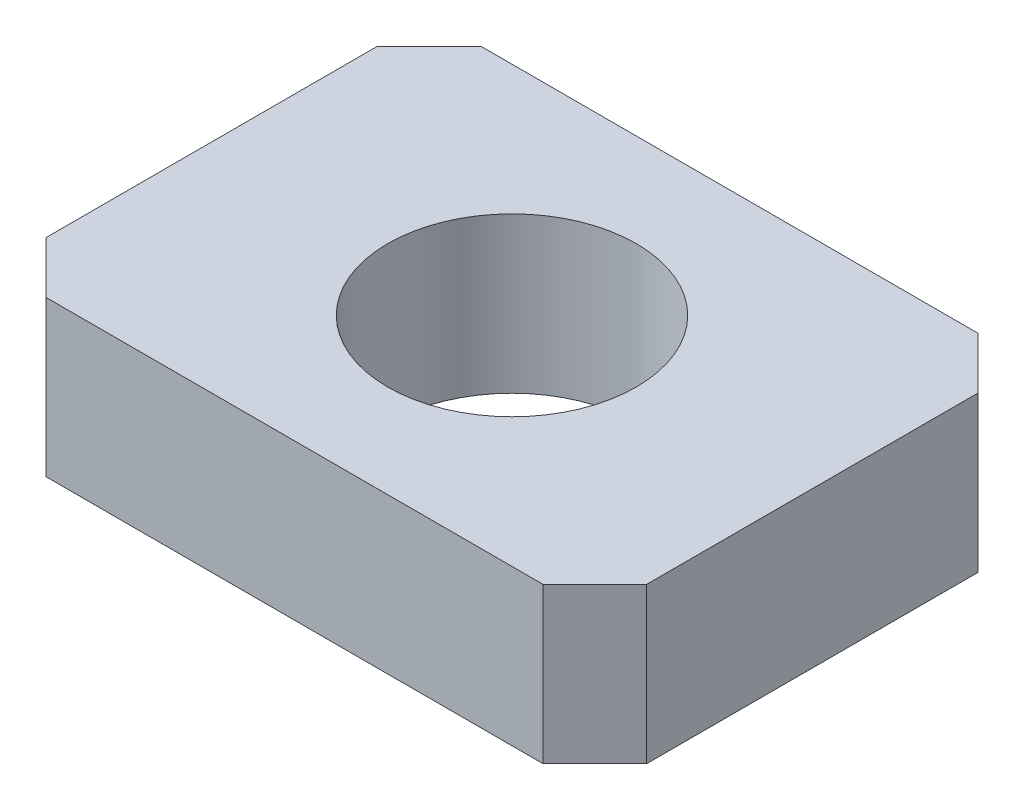
ISO-10303-21;
HEADER;
FILE_DESCRIPTION(('STEP AP214'),'2;1');
FILE_NAME('part.step','',(''),(''),'','','');
FILE_SCHEMA(('AUTOMOTIVE_DESIGN { 1 0 10303 214 1 1 1 1 }'));
ENDSEC;
DATA;
#1=APPLICATION_CONTEXT('core data for automotive mechanical design processes');
#2=APPLICATION_PROTOCOL_DEFINITION('international standard','automotive_design',2000,#1);
#3=PRODUCT_CONTEXT('',#1,'mechanical');
#4=PRODUCT('Part','Part','',(#3));
#5=PRODUCT_RELATED_PRODUCT_CATEGORY('part','',(#4));
#6=PRODUCT_DEFINITION_FORMATION('','',#4);
#7=PRODUCT_DEFINITION_CONTEXT('part definition',#1,'design');
#8=PRODUCT_DEFINITION('design','',#6,#7);
#9=PRODUCT_DEFINITION_SHAPE('','',#8);
#10=(LENGTH_UNIT() NAMED_UNIT(*) SI_UNIT(.MILLI.,.METRE.));
#11=(NAMED_UNIT(*) PLANE_ANGLE_UNIT() SI_UNIT($,.RADIAN.));
#12=(NAMED_UNIT(*) SI_UNIT($,.STERADIAN.) SOLID_ANGLE_UNIT());
#13=UNCERTAINTY_MEASURE_WITH_UNIT(LENGTH_MEASURE(1.E-05),#10,'distance_accuracy_value','');
#14=(GEOMETRIC_REPRESENTATION_CONTEXT(3) GLOBAL_UNCERTAINTY_ASSIGNED_CONTEXT((#13)) GLOBAL_UNIT_ASSIGNED_CONTEXT((#10,
#11,#12)) REPRESENTATION_CONTEXT('',''));
#15=CARTESIAN_POINT('',(0.,0.,0.));
#16=DIRECTION('',(0.,0.,1.));
#17=DIRECTION('',(1.,0.,0.));
#18=AXIS2_PLACEMENT_3D('',#15,#16,#17);
#19=CARTESIAN_POINT('',(0.,1.5,0.));
#20=DIRECTION('',(0.,-1.,0.));
#21=DIRECTION('',(0.,0.,-1.));
#22=AXIS2_PLACEMENT_3D('',#19,#20,#21);
#23=PLANE('',#22);
#24=DIRECTION('',(0.,0.,-1.));
#25=VECTOR('',#24,1.);
#26=CARTESIAN_POINT('',(2.9,1.5,2.1));
#27=LINE('',#26,#25);
#28=CARTESIAN_POINT('',(2.9,1.5,1.6));
#29=VERTEX_POINT('',#28);
#30=CARTESIAN_POINT('',(2.9,1.5,-1.6));
#31=VERTEX_POINT('',#30);
#32=EDGE_CURVE('E145',#29,#31,#27,.T.);
#33=ORIENTED_EDGE('',*,*,#32,.T.);
#34=DIRECTION('',(0.707106781186546,0.,0.707106781186549));
#35=VECTOR('',#34,1.);
#36=CARTESIAN_POINT('',(2.4,1.5,-2.1));
#37=LINE('',#36,#35);
#38=CARTESIAN_POINT('',(2.4,1.5,-2.1));
#39=VERTEX_POINT('',#38);
#40=EDGE_CURVE('E163',#31,#39,#37,.F.);
#41=ORIENTED_EDGE('',*,*,#40,.T.);
#42=DIRECTION('',(-1.,0.,0.));
#43=VECTOR('',#42,1.);
#44=CARTESIAN_POINT('',(-2.9,1.5,-2.1));
#45=LINE('',#44,#43);
#46=CARTESIAN_POINT('',(-2.4,1.5,-2.1));
#47=VERTEX_POINT('',#46);
#48=EDGE_CURVE('E127',#39,#47,#45,.T.);
#49=ORIENTED_EDGE('',*,*,#48,.T.);
#50=DIRECTION('',(0.707106781186549,0.,-0.707106781186546));
#51=VECTOR('',#50,1.);
#52=CARTESIAN_POINT('',(-2.9,1.5,-1.6));
#53=LINE('',#52,#51);
#54=CARTESIAN_POINT('',(-2.9,1.5,-1.6));
#55=VERTEX_POINT('',#54);
#56=EDGE_CURVE('E155',#47,#55,#53,.F.);
#57=ORIENTED_EDGE('',*,*,#56,.T.);
#58=DIRECTION('',(0.,0.,1.));
#59=VECTOR('',#58,1.);
#60=CARTESIAN_POINT('',(-2.9,1.5,-2.1));
#61=LINE('',#60,#59);
#62=CARTESIAN_POINT('',(-2.9,1.5,1.6));
#63=VERTEX_POINT('',#62);
#64=EDGE_CURVE('E175',#55,#63,#61,.T.);
#65=ORIENTED_EDGE('',*,*,#64,.T.);
#66=DIRECTION('',(-0.707106781186546,0.,-0.707106781186549));
#67=VECTOR('',#66,1.);
#68=CARTESIAN_POINT('',(-2.4,1.5,2.1));
#69=LINE('',#68,#67);
#70=CARTESIAN_POINT('',(-2.4,1.5,2.1));
#71=VERTEX_POINT('',#70);
#72=EDGE_CURVE('E63',#63,#71,#69,.F.);
#73=ORIENTED_EDGE('',*,*,#72,.T.);
#74=DIRECTION('',(1.,0.,0.));
#75=VECTOR('',#74,1.);
#76=CARTESIAN_POINT('',(-2.9,1.5,2.1));
#77=LINE('',#76,#75);
#78=CARTESIAN_POINT('',(2.4,1.5,2.1));
#79=VERTEX_POINT('',#78);
#80=EDGE_CURVE('E146',#71,#79,#77,.T.);
#81=ORIENTED_EDGE('',*,*,#80,.T.);
#82=DIRECTION('',(-0.707106781186549,0.,0.707106781186546));
#83=VECTOR('',#82,1.);
#84=CARTESIAN_POINT('',(2.9,1.5,1.6));
#85=LINE('',#84,#83);
#86=EDGE_CURVE('E160',#79,#29,#85,.F.);
#87=ORIENTED_EDGE('',*,*,#86,.T.);
#88=EDGE_LOOP('',(#33,#41,#49,#57,#65,#73,#81,#87));
#89=FACE_BOUND('',#88,.T.);
#90=CARTESIAN_POINT('',(0.,1.5,0.));
#91=DIRECTION('',(0.,1.,0.));
#92=DIRECTION('',(0.,0.,1.));
#93=AXIS2_PLACEMENT_3D('',#90,#91,#92);
#94=CIRCLE('',#93,1.2);
#95=CARTESIAN_POINT('',(0.,1.5,1.2));
#96=VERTEX_POINT('',#95);
#97=EDGE_CURVE('E140',#96,#96,#94,.T.);
#98=ORIENTED_EDGE('',*,*,#97,.F.);
#99=EDGE_LOOP('',(#98));
#100=FACE_BOUND('',#99,.T.);
#101=ADVANCED_FACE('F40',(#89,#100),#23,.F.);
#102=CARTESIAN_POINT('',(0.,0.,0.));
#103=DIRECTION('',(0.,-1.,0.));
#104=DIRECTION('',(0.,0.,-1.));
#105=AXIS2_PLACEMENT_3D('',#102,#103,#104);
#106=PLANE('',#105);
#107=DIRECTION('',(-1.,0.,0.));
#108=VECTOR('',#107,1.);
#109=CARTESIAN_POINT('',(-2.9,0.,-2.1));
#110=LINE('',#109,#108);
#111=CARTESIAN_POINT('',(2.4,0.,-2.1));
#112=VERTEX_POINT('',#111);
#113=CARTESIAN_POINT('',(-2.4,0.,-2.1));
#114=VERTEX_POINT('',#113);
#115=EDGE_CURVE('E124',#112,#114,#110,.T.);
#116=ORIENTED_EDGE('',*,*,#115,.F.);
#117=DIRECTION('',(-0.707106781186546,0.,-0.707106781186549));
#118=VECTOR('',#117,1.);
#119=CARTESIAN_POINT('',(2.25000000000001,0.,-2.25));
#120=LINE('',#119,#118);
#121=CARTESIAN_POINT('',(2.9,0.,-1.6));
#122=VERTEX_POINT('',#121);
#123=EDGE_CURVE('E107',#112,#122,#120,.F.);
#124=ORIENTED_EDGE('',*,*,#123,.T.);
#125=DIRECTION('',(0.,0.,-1.));
#126=VECTOR('',#125,1.);
#127=CARTESIAN_POINT('',(2.9,0.,2.1));
#128=LINE('',#127,#126);
#129=CARTESIAN_POINT('',(2.9,0.,1.6));
#130=VERTEX_POINT('',#129);
#131=EDGE_CURVE('E135',#130,#122,#128,.T.);
#132=ORIENTED_EDGE('',*,*,#131,.F.);
#133=DIRECTION('',(0.707106781186549,0.,-0.707106781186546));
#134=VECTOR('',#133,1.);
#135=CARTESIAN_POINT('',(2.24999999999999,0.,2.25));
#136=LINE('',#135,#134);
#137=CARTESIAN_POINT('',(2.4,0.,2.1));
#138=VERTEX_POINT('',#137);
#139=EDGE_CURVE('E118',#130,#138,#136,.F.);
#140=ORIENTED_EDGE('',*,*,#139,.T.);
#141=DIRECTION('',(1.,0.,0.));
#142=VECTOR('',#141,1.);
#143=CARTESIAN_POINT('',(-2.9,0.,2.1));
#144=LINE('',#143,#142);
#145=CARTESIAN_POINT('',(-2.4,0.,2.1));
#146=VERTEX_POINT('',#145);
#147=EDGE_CURVE('E138',#146,#138,#144,.T.);
#148=ORIENTED_EDGE('',*,*,#147,.F.);
#149=DIRECTION('',(0.707106781186546,0.,0.707106781186549));
#150=VECTOR('',#149,1.);
#151=CARTESIAN_POINT('',(-2.25,0.,2.25));
#152=LINE('',#151,#150);
#153=CARTESIAN_POINT('',(-2.9,0.,1.6));
#154=VERTEX_POINT('',#153);
#155=EDGE_CURVE('E149',#146,#154,#152,.F.);
#156=ORIENTED_EDGE('',*,*,#155,.T.);
#157=DIRECTION('',(0.,0.,1.));
#158=VECTOR('',#157,1.);
#159=CARTESIAN_POINT('',(-2.9,0.,-2.1));
#160=LINE('',#159,#158);
#161=CARTESIAN_POINT('',(-2.9,0.,-1.6));
#162=VERTEX_POINT('',#161);
#163=EDGE_CURVE('E134',#162,#154,#160,.T.);
#164=ORIENTED_EDGE('',*,*,#163,.F.);
#165=DIRECTION('',(-0.707106781186549,0.,0.707106781186546));
#166=VECTOR('',#165,1.);
#167=CARTESIAN_POINT('',(-2.24999999999999,0.,-2.25));
#168=LINE('',#167,#166);
#169=EDGE_CURVE('E128',#162,#114,#168,.F.);
#170=ORIENTED_EDGE('',*,*,#169,.T.);
#171=EDGE_LOOP('',(#116,#124,#132,#140,#148,#156,#164,#170));
#172=FACE_BOUND('',#171,.T.);
#173=CARTESIAN_POINT('',(0.,0.,0.));
#174=DIRECTION('',(0.,1.,0.));
#175=DIRECTION('',(0.,0.,1.));
#176=AXIS2_PLACEMENT_3D('',#173,#174,#175);
#177=CIRCLE('',#176,1.2);
#178=CARTESIAN_POINT('',(0.,0.,1.2));
#179=VERTEX_POINT('',#178);
#180=EDGE_CURVE('E200',#179,#179,#177,.T.);
#181=ORIENTED_EDGE('',*,*,#180,.T.);
#182=EDGE_LOOP('',(#181));
#183=FACE_BOUND('',#182,.T.);
#184=ADVANCED_FACE('F131',(#172,#183),#106,.T.);
#185=CARTESIAN_POINT('',(2.9,1.5,2.1));
#186=DIRECTION('',(-1.,0.,0.));
#187=DIRECTION('',(0.,0.,1.));
#188=AXIS2_PLACEMENT_3D('',#185,#186,#187);
#189=PLANE('',#188);
#190=ORIENTED_EDGE('',*,*,#131,.T.);
#191=DIRECTION('',(0.,1.,0.));
#192=VECTOR('',#191,1.);
#193=CARTESIAN_POINT('',(2.9,1.5,-1.6));
#194=LINE('',#193,#192);
#195=EDGE_CURVE('E112',#122,#31,#194,.T.);
#196=ORIENTED_EDGE('',*,*,#195,.T.);
#197=ORIENTED_EDGE('',*,*,#32,.F.);
#198=DIRECTION('',(0.,-1.,0.));
#199=VECTOR('',#198,1.);
#200=CARTESIAN_POINT('',(2.9,1.5,1.6));
#201=LINE('',#200,#199);
#202=EDGE_CURVE('E117',#29,#130,#201,.T.);
#203=ORIENTED_EDGE('',*,*,#202,.T.);
#204=EDGE_LOOP('',(#190,#196,#197,#203));
#205=FACE_BOUND('',#204,.T.);
#206=ADVANCED_FACE('F215',(#205),#189,.F.);
#207=CARTESIAN_POINT('',(-2.9,1.5,-2.1));
#208=DIRECTION('',(0.,0.,1.));
#209=DIRECTION('',(1.,0.,0.));
#210=AXIS2_PLACEMENT_3D('',#207,#208,#209);
#211=PLANE('',#210);
#212=ORIENTED_EDGE('',*,*,#48,.F.);
#213=DIRECTION('',(0.,-1.,0.));
#214=VECTOR('',#213,1.);
#215=CARTESIAN_POINT('',(2.4,1.5,-2.1));
#216=LINE('',#215,#214);
#217=EDGE_CURVE('E111',#39,#112,#216,.T.);
#218=ORIENTED_EDGE('',*,*,#217,.T.);
#219=ORIENTED_EDGE('',*,*,#115,.T.);
#220=DIRECTION('',(0.,1.,0.));
#221=VECTOR('',#220,1.);
#222=CARTESIAN_POINT('',(-2.4,1.5,-2.1));
#223=LINE('',#222,#221);
#224=EDGE_CURVE('E129',#114,#47,#223,.T.);
#225=ORIENTED_EDGE('',*,*,#224,.T.);
#226=EDGE_LOOP('',(#212,#218,#219,#225));
#227=FACE_BOUND('',#226,.T.);
#228=ADVANCED_FACE('F123',(#227),#211,.F.);
#229=CARTESIAN_POINT('',(-2.9,1.5,-2.1));
#230=DIRECTION('',(1.,0.,0.));
#231=DIRECTION('',(0.,0.,-1.));
#232=AXIS2_PLACEMENT_3D('',#229,#230,#231);
#233=PLANE('',#232);
#234=ORIENTED_EDGE('',*,*,#163,.T.);
#235=DIRECTION('',(0.,1.,0.));
#236=VECTOR('',#235,1.);
#237=CARTESIAN_POINT('',(-2.9,1.5,1.6));
#238=LINE('',#237,#236);
#239=EDGE_CURVE('E12',#154,#63,#238,.T.);
#240=ORIENTED_EDGE('',*,*,#239,.T.);
#241=ORIENTED_EDGE('',*,*,#64,.F.);
#242=DIRECTION('',(0.,-1.,0.));
#243=VECTOR('',#242,1.);
#244=CARTESIAN_POINT('',(-2.9,1.5,-1.6));
#245=LINE('',#244,#243);
#246=EDGE_CURVE('E49',#55,#162,#245,.T.);
#247=ORIENTED_EDGE('',*,*,#246,.T.);
#248=EDGE_LOOP('',(#234,#240,#241,#247));
#249=FACE_BOUND('',#248,.T.);
#250=ADVANCED_FACE('F173',(#249),#233,.F.);
#251=CARTESIAN_POINT('',(-2.9,1.5,2.1));
#252=DIRECTION('',(0.,0.,-1.));
#253=DIRECTION('',(-1.,0.,0.));
#254=AXIS2_PLACEMENT_3D('',#251,#252,#253);
#255=PLANE('',#254);
#256=ORIENTED_EDGE('',*,*,#147,.T.);
#257=DIRECTION('',(0.,1.,0.));
#258=VECTOR('',#257,1.);
#259=CARTESIAN_POINT('',(2.4,1.5,2.1));
#260=LINE('',#259,#258);
#261=EDGE_CURVE('E56',#138,#79,#260,.T.);
#262=ORIENTED_EDGE('',*,*,#261,.T.);
#263=ORIENTED_EDGE('',*,*,#80,.F.);
#264=DIRECTION('',(0.,-1.,0.));
#265=VECTOR('',#264,1.);
#266=CARTESIAN_POINT('',(-2.4,1.5,2.1));
#267=LINE('',#266,#265);
#268=EDGE_CURVE('E166',#71,#146,#267,.T.);
#269=ORIENTED_EDGE('',*,*,#268,.T.);
#270=EDGE_LOOP('',(#256,#262,#263,#269));
#271=FACE_BOUND('',#270,.T.);
#272=ADVANCED_FACE('F182',(#271),#255,.F.);
#273=CARTESIAN_POINT('',(0.,1.5,0.));
#274=DIRECTION('',(0.,-1.,0.));
#275=DIRECTION('',(0.,0.,-1.));
#276=AXIS2_PLACEMENT_3D('',#273,#274,#275);
#277=CYLINDRICAL_SURFACE('',#276,1.2);
#278=ORIENTED_EDGE('',*,*,#97,.T.);
#279=EDGE_LOOP('',(#278));
#280=FACE_BOUND('',#279,.T.);
#281=ORIENTED_EDGE('',*,*,#180,.F.);
#282=EDGE_LOOP('',(#281));
#283=FACE_BOUND('',#282,.T.);
#284=ADVANCED_FACE('F207',(#280,#283),#277,.F.);
#285=CARTESIAN_POINT('',(2.4,1.5,-2.1));
#286=DIRECTION('',(-0.707106781186549,0.,0.707106781186546));
#287=DIRECTION('',(0.,-1.,0.));
#288=AXIS2_PLACEMENT_3D('',#285,#286,#287);
#289=PLANE('',#288);
#290=ORIENTED_EDGE('',*,*,#40,.F.);
#291=ORIENTED_EDGE('',*,*,#195,.F.);
#292=ORIENTED_EDGE('',*,*,#123,.F.);
#293=ORIENTED_EDGE('',*,*,#217,.F.);
#294=EDGE_LOOP('',(#290,#291,#292,#293));
#295=FACE_BOUND('',#294,.T.);
#296=ADVANCED_FACE('F110',(#295),#289,.F.);
#297=CARTESIAN_POINT('',(2.9,1.5,1.6));
#298=DIRECTION('',(-0.707106781186546,0.,-0.707106781186549));
#299=DIRECTION('',(0.,-1.,0.));
#300=AXIS2_PLACEMENT_3D('',#297,#298,#299);
#301=PLANE('',#300);
#302=ORIENTED_EDGE('',*,*,#86,.F.);
#303=ORIENTED_EDGE('',*,*,#261,.F.);
#304=ORIENTED_EDGE('',*,*,#139,.F.);
#305=ORIENTED_EDGE('',*,*,#202,.F.);
#306=EDGE_LOOP('',(#302,#303,#304,#305));
#307=FACE_BOUND('',#306,.T.);
#308=ADVANCED_FACE('F234',(#307),#301,.F.);
#309=CARTESIAN_POINT('',(-2.4,1.5,2.1));
#310=DIRECTION('',(0.707106781186549,0.,-0.707106781186546));
#311=DIRECTION('',(0.,-1.,0.));
#312=AXIS2_PLACEMENT_3D('',#309,#310,#311);
#313=PLANE('',#312);
#314=ORIENTED_EDGE('',*,*,#72,.F.);
#315=ORIENTED_EDGE('',*,*,#239,.F.);
#316=ORIENTED_EDGE('',*,*,#155,.F.);
#317=ORIENTED_EDGE('',*,*,#268,.F.);
#318=EDGE_LOOP('',(#314,#315,#316,#317));
#319=FACE_BOUND('',#318,.T.);
#320=ADVANCED_FACE('F181',(#319),#313,.F.);
#321=CARTESIAN_POINT('',(-2.9,1.5,-1.6));
#322=DIRECTION('',(0.707106781186546,0.,0.707106781186549));
#323=DIRECTION('',(0.,-1.,0.));
#324=AXIS2_PLACEMENT_3D('',#321,#322,#323);
#325=PLANE('',#324);
#326=ORIENTED_EDGE('',*,*,#56,.F.);
#327=ORIENTED_EDGE('',*,*,#224,.F.);
#328=ORIENTED_EDGE('',*,*,#169,.F.);
#329=ORIENTED_EDGE('',*,*,#246,.F.);
#330=EDGE_LOOP('',(#326,#327,#328,#329));
#331=FACE_BOUND('',#330,.T.);
#332=ADVANCED_FACE('F43',(#331),#325,.F.);
#333=CLOSED_SHELL('',(#101,#184,#206,#228,#250,#272,#284,#296,#308,#320,#332));
#334=MANIFOLD_SOLID_BREP('B2',#333);
#335=ADVANCED_BREP_SHAPE_REPRESENTATION('',(#18,#334),#14);
#336=SHAPE_DEFINITION_REPRESENTATION(#9,#335);
ENDSEC;
END-ISO-10303-21;
